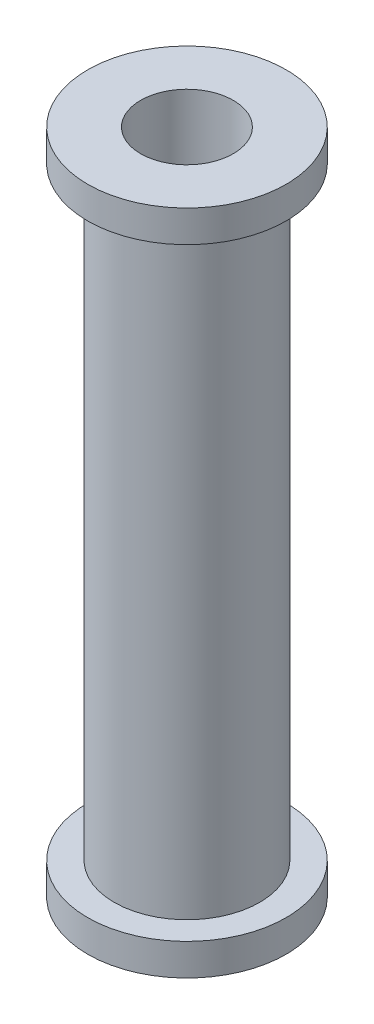
ISO-10303-21;
HEADER;
FILE_DESCRIPTION(('STEP AP214'),'2;1');
FILE_NAME('part.step','',(''),(''),'','','');
FILE_SCHEMA(('AUTOMOTIVE_DESIGN { 1 0 10303 214 1 1 1 1 }'));
ENDSEC;
DATA;
#1=APPLICATION_CONTEXT('core data for automotive mechanical design processes');
#2=APPLICATION_PROTOCOL_DEFINITION('international standard','automotive_design',2000,#1);
#3=PRODUCT_CONTEXT('',#1,'mechanical');
#4=PRODUCT('Part','Part','',(#3));
#5=PRODUCT_RELATED_PRODUCT_CATEGORY('part','',(#4));
#6=PRODUCT_DEFINITION_FORMATION('','',#4);
#7=PRODUCT_DEFINITION_CONTEXT('part definition',#1,'design');
#8=PRODUCT_DEFINITION('design','',#6,#7);
#9=PRODUCT_DEFINITION_SHAPE('','',#8);
#10=(LENGTH_UNIT() NAMED_UNIT(*) SI_UNIT(.MILLI.,.METRE.));
#11=(NAMED_UNIT(*) PLANE_ANGLE_UNIT() SI_UNIT($,.RADIAN.));
#12=(NAMED_UNIT(*) SI_UNIT($,.STERADIAN.) SOLID_ANGLE_UNIT());
#13=UNCERTAINTY_MEASURE_WITH_UNIT(LENGTH_MEASURE(1.E-05),#10,'distance_accuracy_value','');
#14=(GEOMETRIC_REPRESENTATION_CONTEXT(3) GLOBAL_UNCERTAINTY_ASSIGNED_CONTEXT((#13)) GLOBAL_UNIT_ASSIGNED_CONTEXT((#10,
#11,#12)) REPRESENTATION_CONTEXT('',''));
#15=CARTESIAN_POINT('',(0.,0.,0.));
#16=DIRECTION('',(0.,0.,1.));
#17=DIRECTION('',(1.,0.,0.));
#18=AXIS2_PLACEMENT_3D('',#15,#16,#17);
#19=CARTESIAN_POINT('',(0.,3.048,0.));
#20=DIRECTION('',(0.,1.,0.));
#21=DIRECTION('',(0.,0.,1.));
#22=AXIS2_PLACEMENT_3D('',#19,#20,#21);
#23=PLANE('',#22);
#24=CARTESIAN_POINT('',(0.,3.048,0.));
#25=DIRECTION('',(0.,1.,0.));
#26=DIRECTION('',(0.,0.,1.));
#27=AXIS2_PLACEMENT_3D('',#24,#25,#26);
#28=CIRCLE('',#27,9.525);
#29=CARTESIAN_POINT('',(0.,3.048,9.525));
#30=VERTEX_POINT('',#29);
#31=EDGE_CURVE('E10',#30,#30,#28,.T.);
#32=ORIENTED_EDGE('',*,*,#31,.T.);
#33=EDGE_LOOP('',(#32));
#34=FACE_BOUND('',#33,.T.);
#35=CARTESIAN_POINT('',(0.,3.048,0.));
#36=DIRECTION('',(0.,1.,0.));
#37=DIRECTION('',(0.,0.,1.));
#38=AXIS2_PLACEMENT_3D('',#35,#36,#37);
#39=CIRCLE('',#38,6.985);
#40=CARTESIAN_POINT('',(0.,3.048,6.985));
#41=VERTEX_POINT('',#40);
#42=EDGE_CURVE('E51',#41,#41,#39,.T.);
#43=ORIENTED_EDGE('',*,*,#42,.F.);
#44=EDGE_LOOP('',(#43));
#45=FACE_BOUND('',#44,.T.);
#46=ADVANCED_FACE('F35',(#34,#45),#23,.T.);
#47=CARTESIAN_POINT('',(0.,0.,0.));
#48=DIRECTION('',(0.,1.,0.));
#49=DIRECTION('',(0.,0.,1.));
#50=AXIS2_PLACEMENT_3D('',#47,#48,#49);
#51=PLANE('',#50);
#52=CARTESIAN_POINT('',(0.,0.,0.));
#53=DIRECTION('',(0.,1.,0.));
#54=DIRECTION('',(0.,0.,1.));
#55=AXIS2_PLACEMENT_3D('',#52,#53,#54);
#56=CIRCLE('',#55,9.525);
#57=CARTESIAN_POINT('',(0.,0.,9.525));
#58=VERTEX_POINT('',#57);
#59=EDGE_CURVE('E39',#58,#58,#56,.T.);
#60=ORIENTED_EDGE('',*,*,#59,.F.);
#61=EDGE_LOOP('',(#60));
#62=FACE_BOUND('',#61,.T.);
#63=CARTESIAN_POINT('',(0.,0.,0.));
#64=DIRECTION('',(0.,1.,0.));
#65=DIRECTION('',(0.,0.,1.));
#66=AXIS2_PLACEMENT_3D('',#63,#64,#65);
#67=CIRCLE('',#66,4.445);
#68=CARTESIAN_POINT('',(0.,0.,4.445));
#69=VERTEX_POINT('',#68);
#70=EDGE_CURVE('E46',#69,#69,#67,.T.);
#71=ORIENTED_EDGE('',*,*,#70,.T.);
#72=EDGE_LOOP('',(#71));
#73=FACE_BOUND('',#72,.T.);
#74=ADVANCED_FACE('F85',(#62,#73),#51,.F.);
#75=CARTESIAN_POINT('',(0.,3.048,0.));
#76=DIRECTION('',(0.,-1.,0.));
#77=DIRECTION('',(0.,0.,-1.));
#78=AXIS2_PLACEMENT_3D('',#75,#76,#77);
#79=CYLINDRICAL_SURFACE('',#78,9.525);
#80=ORIENTED_EDGE('',*,*,#31,.F.);
#81=EDGE_LOOP('',(#80));
#82=FACE_BOUND('',#81,.T.);
#83=ORIENTED_EDGE('',*,*,#59,.T.);
#84=EDGE_LOOP('',(#83));
#85=FACE_BOUND('',#84,.T.);
#86=ADVANCED_FACE('F37',(#82,#85),#79,.T.);
#87=CARTESIAN_POINT('',(0.,3.048,0.));
#88=DIRECTION('',(0.,-1.,0.));
#89=DIRECTION('',(0.,0.,-1.));
#90=AXIS2_PLACEMENT_3D('',#87,#88,#89);
#91=CYLINDRICAL_SURFACE('',#90,4.445);
#92=ORIENTED_EDGE('',*,*,#70,.F.);
#93=EDGE_LOOP('',(#92));
#94=FACE_BOUND('',#93,.T.);
#95=CARTESIAN_POINT('',(0.,64.008,0.));
#96=DIRECTION('',(0.,1.,0.));
#97=DIRECTION('',(0.,0.,1.));
#98=AXIS2_PLACEMENT_3D('',#95,#96,#97);
#99=CIRCLE('',#98,4.445);
#100=CARTESIAN_POINT('',(0.,64.008,4.445));
#101=VERTEX_POINT('',#100);
#102=EDGE_CURVE('E54',#101,#101,#99,.F.);
#103=ORIENTED_EDGE('',*,*,#102,.F.);
#104=EDGE_LOOP('',(#103));
#105=FACE_BOUND('',#104,.T.);
#106=ADVANCED_FACE('F93',(#94,#105),#91,.F.);
#107=CARTESIAN_POINT('',(0.,60.96,0.));
#108=DIRECTION('',(0.,-1.,0.));
#109=DIRECTION('',(0.,0.,-1.));
#110=AXIS2_PLACEMENT_3D('',#107,#108,#109);
#111=CYLINDRICAL_SURFACE('',#110,6.985);
#112=CARTESIAN_POINT('',(0.,60.96,0.));
#113=DIRECTION('',(0.,1.,0.));
#114=DIRECTION('',(0.,0.,1.));
#115=AXIS2_PLACEMENT_3D('',#112,#113,#114);
#116=CIRCLE('',#115,6.985);
#117=CARTESIAN_POINT('',(0.,60.96,6.985));
#118=VERTEX_POINT('',#117);
#119=EDGE_CURVE('E50',#118,#118,#116,.T.);
#120=ORIENTED_EDGE('',*,*,#119,.F.);
#121=EDGE_LOOP('',(#120));
#122=FACE_BOUND('',#121,.T.);
#123=ORIENTED_EDGE('',*,*,#42,.T.);
#124=EDGE_LOOP('',(#123));
#125=FACE_BOUND('',#124,.T.);
#126=ADVANCED_FACE('F72',(#122,#125),#111,.T.);
#127=CARTESIAN_POINT('',(0.,64.008,0.));
#128=DIRECTION('',(0.,-1.,0.));
#129=DIRECTION('',(0.,0.,-1.));
#130=AXIS2_PLACEMENT_3D('',#127,#128,#129);
#131=CYLINDRICAL_SURFACE('',#130,9.525);
#132=CARTESIAN_POINT('',(0.,64.008,0.));
#133=DIRECTION('',(0.,1.,0.));
#134=DIRECTION('',(0.,0.,1.));
#135=AXIS2_PLACEMENT_3D('',#132,#133,#134);
#136=CIRCLE('',#135,9.525);
#137=CARTESIAN_POINT('',(0.,64.008,9.525));
#138=VERTEX_POINT('',#137);
#139=EDGE_CURVE('E60',#138,#138,#136,.T.);
#140=ORIENTED_EDGE('',*,*,#139,.F.);
#141=EDGE_LOOP('',(#140));
#142=FACE_BOUND('',#141,.T.);
#143=CARTESIAN_POINT('',(0.,60.96,0.));
#144=DIRECTION('',(0.,1.,0.));
#145=DIRECTION('',(0.,0.,1.));
#146=AXIS2_PLACEMENT_3D('',#143,#144,#145);
#147=CIRCLE('',#146,9.525);
#148=CARTESIAN_POINT('',(0.,60.96,9.525));
#149=VERTEX_POINT('',#148);
#150=EDGE_CURVE('E57',#149,#149,#147,.T.);
#151=ORIENTED_EDGE('',*,*,#150,.T.);
#152=EDGE_LOOP('',(#151));
#153=FACE_BOUND('',#152,.T.);
#154=ADVANCED_FACE('F69',(#142,#153),#131,.T.);
#155=CARTESIAN_POINT('',(0.,64.008,0.));
#156=DIRECTION('',(0.,1.,0.));
#157=DIRECTION('',(0.,0.,1.));
#158=AXIS2_PLACEMENT_3D('',#155,#156,#157);
#159=PLANE('',#158);
#160=ORIENTED_EDGE('',*,*,#139,.T.);
#161=EDGE_LOOP('',(#160));
#162=FACE_BOUND('',#161,.T.);
#163=ORIENTED_EDGE('',*,*,#102,.T.);
#164=EDGE_LOOP('',(#163));
#165=FACE_BOUND('',#164,.T.);
#166=ADVANCED_FACE('F66',(#162,#165),#159,.T.);
#167=CARTESIAN_POINT('',(0.,60.96,0.));
#168=DIRECTION('',(0.,1.,0.));
#169=DIRECTION('',(0.,0.,1.));
#170=AXIS2_PLACEMENT_3D('',#167,#168,#169);
#171=PLANE('',#170);
#172=ORIENTED_EDGE('',*,*,#119,.T.);
#173=EDGE_LOOP('',(#172));
#174=FACE_BOUND('',#173,.T.);
#175=ORIENTED_EDGE('',*,*,#150,.F.);
#176=EDGE_LOOP('',(#175));
#177=FACE_BOUND('',#176,.T.);
#178=ADVANCED_FACE('F76',(#174,#177),#171,.F.);
#179=CLOSED_SHELL('',(#46,#74,#86,#106,#126,#154,#166,#178));
#180=MANIFOLD_SOLID_BREP('B2',#179);
#181=ADVANCED_BREP_SHAPE_REPRESENTATION('',(#18,#180),#14);
#182=SHAPE_DEFINITION_REPRESENTATION(#9,#181);
ENDSEC;
END-ISO-10303-21;
